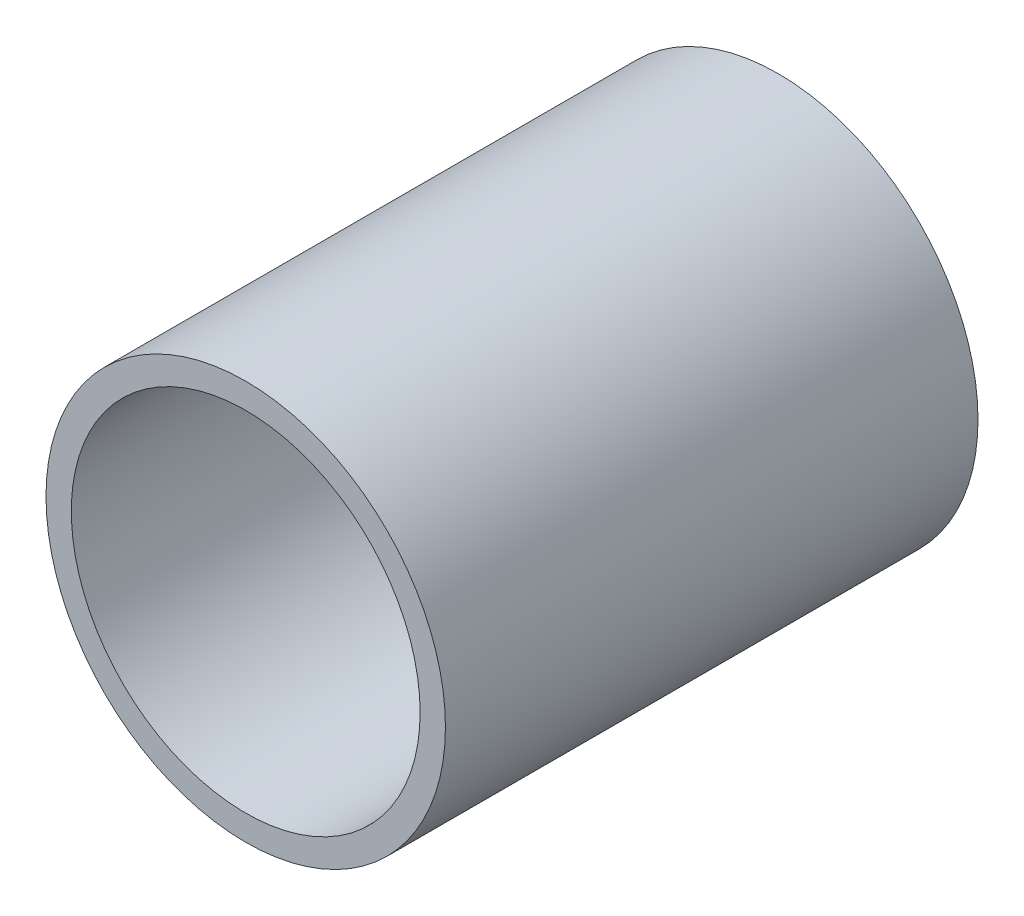
ISO-10303-21;
HEADER;
FILE_DESCRIPTION(('STEP AP214'),'2;1');
FILE_NAME('part.step','',(''),(''),'','','');
FILE_SCHEMA(('AUTOMOTIVE_DESIGN { 1 0 10303 214 1 1 1 1 }'));
ENDSEC;
DATA;
#1=APPLICATION_CONTEXT('core data for automotive mechanical design processes');
#2=APPLICATION_PROTOCOL_DEFINITION('international standard','automotive_design',2000,#1);
#3=PRODUCT_CONTEXT('',#1,'mechanical');
#4=PRODUCT('Part','Part','',(#3));
#5=PRODUCT_RELATED_PRODUCT_CATEGORY('part','',(#4));
#6=PRODUCT_DEFINITION_FORMATION('','',#4);
#7=PRODUCT_DEFINITION_CONTEXT('part definition',#1,'design');
#8=PRODUCT_DEFINITION('design','',#6,#7);
#9=PRODUCT_DEFINITION_SHAPE('','',#8);
#10=(LENGTH_UNIT() NAMED_UNIT(*) SI_UNIT(.MILLI.,.METRE.));
#11=(NAMED_UNIT(*) PLANE_ANGLE_UNIT() SI_UNIT($,.RADIAN.));
#12=(NAMED_UNIT(*) SI_UNIT($,.STERADIAN.) SOLID_ANGLE_UNIT());
#13=UNCERTAINTY_MEASURE_WITH_UNIT(LENGTH_MEASURE(1.E-05),#10,'distance_accuracy_value','');
#14=(GEOMETRIC_REPRESENTATION_CONTEXT(3) GLOBAL_UNCERTAINTY_ASSIGNED_CONTEXT((#13)) GLOBAL_UNIT_ASSIGNED_CONTEXT((#10,
#11,#12)) REPRESENTATION_CONTEXT('',''));
#15=CARTESIAN_POINT('',(0.,0.,0.));
#16=DIRECTION('',(0.,0.,1.));
#17=DIRECTION('',(1.,0.,0.));
#18=AXIS2_PLACEMENT_3D('',#15,#16,#17);
#19=CARTESIAN_POINT('',(0.,0.,50.8));
#20=DIRECTION('',(0.,0.,1.));
#21=DIRECTION('',(1.,0.,0.));
#22=AXIS2_PLACEMENT_3D('',#19,#20,#21);
#23=PLANE('',#22);
#24=CARTESIAN_POINT('',(0.,0.,50.8));
#25=DIRECTION('',(0.,0.,1.));
#26=DIRECTION('',(1.,0.,0.));
#27=AXIS2_PLACEMENT_3D('',#24,#25,#26);
#28=CIRCLE('',#27,19.05);
#29=CARTESIAN_POINT('',(19.05,0.,50.8));
#30=VERTEX_POINT('',#29);
#31=EDGE_CURVE('E10',#30,#30,#28,.T.);
#32=ORIENTED_EDGE('',*,*,#31,.T.);
#33=EDGE_LOOP('',(#32));
#34=FACE_BOUND('',#33,.T.);
#35=CARTESIAN_POINT('',(0.,0.,50.8));
#36=DIRECTION('',(0.,0.,1.));
#37=DIRECTION('',(1.,0.,0.));
#38=AXIS2_PLACEMENT_3D('',#35,#36,#37);
#39=CIRCLE('',#38,16.637);
#40=CARTESIAN_POINT('',(16.637,0.,50.8));
#41=VERTEX_POINT('',#40);
#42=EDGE_CURVE('E43',#41,#41,#39,.T.);
#43=ORIENTED_EDGE('',*,*,#42,.F.);
#44=EDGE_LOOP('',(#43));
#45=FACE_BOUND('',#44,.T.);
#46=ADVANCED_FACE('F32',(#34,#45),#23,.T.);
#47=CARTESIAN_POINT('',(0.,0.,0.));
#48=DIRECTION('',(0.,0.,1.));
#49=DIRECTION('',(1.,0.,0.));
#50=AXIS2_PLACEMENT_3D('',#47,#48,#49);
#51=PLANE('',#50);
#52=CARTESIAN_POINT('',(0.,0.,0.));
#53=DIRECTION('',(0.,0.,1.));
#54=DIRECTION('',(1.,0.,0.));
#55=AXIS2_PLACEMENT_3D('',#52,#53,#54);
#56=CIRCLE('',#55,19.05);
#57=CARTESIAN_POINT('',(19.05,0.,0.));
#58=VERTEX_POINT('',#57);
#59=EDGE_CURVE('E36',#58,#58,#56,.T.);
#60=ORIENTED_EDGE('',*,*,#59,.F.);
#61=EDGE_LOOP('',(#60));
#62=FACE_BOUND('',#61,.T.);
#63=CARTESIAN_POINT('',(0.,0.,0.));
#64=DIRECTION('',(0.,0.,1.));
#65=DIRECTION('',(1.,0.,0.));
#66=AXIS2_PLACEMENT_3D('',#63,#64,#65);
#67=CIRCLE('',#66,16.637);
#68=CARTESIAN_POINT('',(16.637,0.,0.));
#69=VERTEX_POINT('',#68);
#70=EDGE_CURVE('E45',#69,#69,#67,.T.);
#71=ORIENTED_EDGE('',*,*,#70,.T.);
#72=EDGE_LOOP('',(#71));
#73=FACE_BOUND('',#72,.T.);
#74=ADVANCED_FACE('F55',(#62,#73),#51,.F.);
#75=CARTESIAN_POINT('',(0.,0.,50.8));
#76=DIRECTION('',(0.,0.,-1.));
#77=DIRECTION('',(-1.,0.,0.));
#78=AXIS2_PLACEMENT_3D('',#75,#76,#77);
#79=CYLINDRICAL_SURFACE('',#78,19.05);
#80=ORIENTED_EDGE('',*,*,#31,.F.);
#81=EDGE_LOOP('',(#80));
#82=FACE_BOUND('',#81,.T.);
#83=ORIENTED_EDGE('',*,*,#59,.T.);
#84=EDGE_LOOP('',(#83));
#85=FACE_BOUND('',#84,.T.);
#86=ADVANCED_FACE('F34',(#82,#85),#79,.T.);
#87=CARTESIAN_POINT('',(0.,0.,50.8));
#88=DIRECTION('',(0.,0.,-1.));
#89=DIRECTION('',(-1.,0.,0.));
#90=AXIS2_PLACEMENT_3D('',#87,#88,#89);
#91=CYLINDRICAL_SURFACE('',#90,16.637);
#92=ORIENTED_EDGE('',*,*,#42,.T.);
#93=EDGE_LOOP('',(#92));
#94=FACE_BOUND('',#93,.T.);
#95=ORIENTED_EDGE('',*,*,#70,.F.);
#96=EDGE_LOOP('',(#95));
#97=FACE_BOUND('',#96,.T.);
#98=ADVANCED_FACE('F51',(#94,#97),#91,.F.);
#99=CLOSED_SHELL('',(#46,#74,#86,#98));
#100=MANIFOLD_SOLID_BREP('B2',#99);
#101=ADVANCED_BREP_SHAPE_REPRESENTATION('',(#18,#100),#14);
#102=SHAPE_DEFINITION_REPRESENTATION(#9,#101);
ENDSEC;
END-ISO-10303-21;
